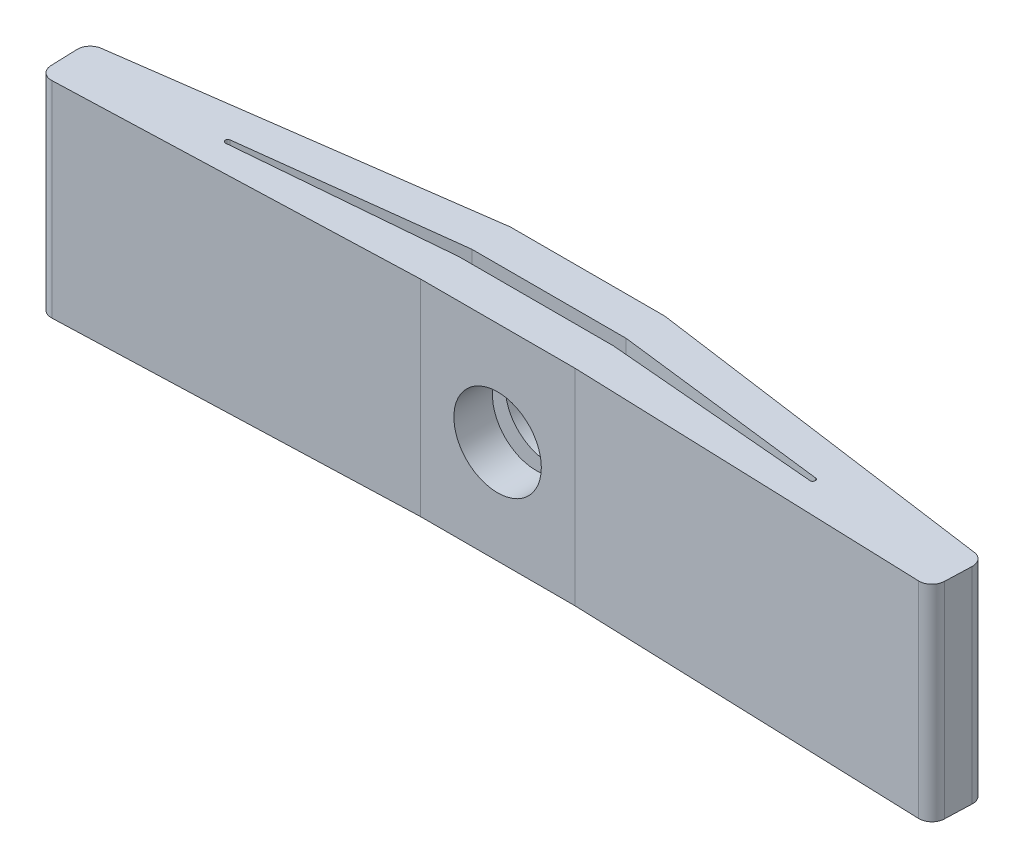
ISO-10303-21;
HEADER;
FILE_DESCRIPTION(('STEP AP214'),'2;1');
FILE_NAME('part.step','',(''),(''),'','','');
FILE_SCHEMA(('AUTOMOTIVE_DESIGN { 1 0 10303 214 1 1 1 1 }'));
ENDSEC;
DATA;
#1=APPLICATION_CONTEXT('core data for automotive mechanical design processes');
#2=APPLICATION_PROTOCOL_DEFINITION('international standard','automotive_design',2000,#1);
#3=PRODUCT_CONTEXT('',#1,'mechanical');
#4=PRODUCT('Part','Part','',(#3));
#5=PRODUCT_RELATED_PRODUCT_CATEGORY('part','',(#4));
#6=PRODUCT_DEFINITION_FORMATION('','',#4);
#7=PRODUCT_DEFINITION_CONTEXT('part definition',#1,'design');
#8=PRODUCT_DEFINITION('design','',#6,#7);
#9=PRODUCT_DEFINITION_SHAPE('','',#8);
#10=(LENGTH_UNIT() NAMED_UNIT(*) SI_UNIT(.MILLI.,.METRE.));
#11=(NAMED_UNIT(*) PLANE_ANGLE_UNIT() SI_UNIT($,.RADIAN.));
#12=(NAMED_UNIT(*) SI_UNIT($,.STERADIAN.) SOLID_ANGLE_UNIT());
#13=UNCERTAINTY_MEASURE_WITH_UNIT(LENGTH_MEASURE(1.E-05),#10,'distance_accuracy_value','');
#14=(GEOMETRIC_REPRESENTATION_CONTEXT(3) GLOBAL_UNCERTAINTY_ASSIGNED_CONTEXT((#13)) GLOBAL_UNIT_ASSIGNED_CONTEXT((#10,
#11,#12)) REPRESENTATION_CONTEXT('',''));
#15=CARTESIAN_POINT('',(0.,0.,0.));
#16=DIRECTION('',(0.,0.,1.));
#17=DIRECTION('',(1.,0.,0.));
#18=AXIS2_PLACEMENT_3D('',#15,#16,#17);
#19=CARTESIAN_POINT('',(34.7,0.,0.));
#20=DIRECTION('',(0.999393527672129,0.,0.0348220741349224));
#21=DIRECTION('',(0.0348220741349224,0.,-0.999393527672129));
#22=AXIS2_PLACEMENT_3D('',#19,#20,#21);
#23=PLANE('',#22);
#24=DIRECTION('',(0.0348220741349224,0.,-0.999393527672129));
#25=VECTOR('',#24,1.);
#26=CARTESIAN_POINT('',(34.7,0.,0.));
#27=LINE('',#26,#25);
#28=CARTESIAN_POINT('',(34.7174110370675,0.,-0.499696763836064));
#29=VERTEX_POINT('',#28);
#30=CARTESIAN_POINT('',(34.7539821688237,0.,-1.54928824524013));
#31=VERTEX_POINT('',#30);
#32=EDGE_CURVE('E249',#29,#31,#27,.T.);
#33=ORIENTED_EDGE('',*,*,#32,.T.);
#34=DIRECTION('',(0.,1.,0.));
#35=VECTOR('',#34,1.);
#36=CARTESIAN_POINT('',(34.7539821688237,0.,-1.54928824524013));
#37=LINE('',#36,#35);
#38=CARTESIAN_POINT('',(34.7539821688237,8.,-1.54928824524013));
#39=VERTEX_POINT('',#38);
#40=EDGE_CURVE('E332',#31,#39,#37,.T.);
#41=ORIENTED_EDGE('',*,*,#40,.T.);
#42=DIRECTION('',(0.0348220741349224,0.,-0.999393527672129));
#43=VECTOR('',#42,1.);
#44=CARTESIAN_POINT('',(34.7,8.,0.));
#45=LINE('',#44,#43);
#46=CARTESIAN_POINT('',(34.7174110370675,8.,-0.499696763836064));
#47=VERTEX_POINT('',#46);
#48=EDGE_CURVE('E237',#47,#39,#45,.T.);
#49=ORIENTED_EDGE('',*,*,#48,.F.);
#50=DIRECTION('',(0.,1.,0.));
#51=VECTOR('',#50,1.);
#52=CARTESIAN_POINT('',(34.7174110370675,0.,-0.499696763836064));
#53=LINE('',#52,#51);
#54=EDGE_CURVE('E330',#47,#29,#53,.F.);
#55=ORIENTED_EDGE('',*,*,#54,.T.);
#56=EDGE_LOOP('',(#33,#41,#49,#55));
#57=FACE_BOUND('',#56,.T.);
#58=ADVANCED_FACE('F33',(#57),#23,.T.);
#59=CARTESIAN_POINT('',(20.3500000000015,0.,-0.499999999999999));
#60=DIRECTION('',(-0.034822074134921,0.,0.999393527672129));
#61=DIRECTION('',(0.999393527672129,0.,0.034822074134921));
#62=AXIS2_PLACEMENT_3D('',#59,#60,#61);
#63=PLANE('',#62);
#64=DIRECTION('',(0.999393527672129,0.,0.034822074134921));
#65=VECTOR('',#64,1.);
#66=CARTESIAN_POINT('',(20.3500000000015,0.,-0.499999999999999));
#67=LINE('',#66,#65);
#68=CARTESIAN_POINT('',(20.3500000000015,0.,-0.499999999999999));
#69=VERTEX_POINT('',#68);
#70=CARTESIAN_POINT('',(34.2003032361639,0.,-0.0174110370674608));
#71=VERTEX_POINT('',#70);
#72=EDGE_CURVE('E269',#69,#71,#67,.T.);
#73=ORIENTED_EDGE('',*,*,#72,.T.);
#74=DIRECTION('',(0.,1.,0.));
#75=VECTOR('',#74,1.);
#76=CARTESIAN_POINT('',(34.2003032361639,0.,-0.0174110370674609));
#77=LINE('',#76,#75);
#78=CARTESIAN_POINT('',(34.2003032361639,8.,-0.0174110370674608));
#79=VERTEX_POINT('',#78);
#80=EDGE_CURVE('E41',#71,#79,#77,.T.);
#81=ORIENTED_EDGE('',*,*,#80,.T.);
#82=DIRECTION('',(0.999393527672129,0.,0.034822074134921));
#83=VECTOR('',#82,1.);
#84=CARTESIAN_POINT('',(20.3500000000015,8.,-0.499999999999999));
#85=LINE('',#84,#83);
#86=CARTESIAN_POINT('',(20.3500000000015,8.,-0.499999999999999));
#87=VERTEX_POINT('',#86);
#88=EDGE_CURVE('E253',#87,#79,#85,.T.);
#89=ORIENTED_EDGE('',*,*,#88,.F.);
#90=DIRECTION('',(0.,1.,0.));
#91=VECTOR('',#90,1.);
#92=CARTESIAN_POINT('',(20.3500000000015,0.,-0.499999999999999));
#93=LINE('',#92,#91);
#94=EDGE_CURVE('E293',#69,#87,#93,.T.);
#95=ORIENTED_EDGE('',*,*,#94,.F.);
#96=EDGE_LOOP('',(#73,#81,#89,#95));
#97=FACE_BOUND('',#96,.T.);
#98=ADVANCED_FACE('F339',(#97),#63,.T.);
#99=CARTESIAN_POINT('',(14.35,0.,-0.5));
#100=DIRECTION('',(0.,0.,1.));
#101=DIRECTION('',(1.,0.,0.));
#102=AXIS2_PLACEMENT_3D('',#99,#100,#101);
#103=PLANE('',#102);
#104=CARTESIAN_POINT('',(17.35,4.,-0.5));
#105=DIRECTION('',(0.,0.,1.));
#106=DIRECTION('',(1.,0.,0.));
#107=AXIS2_PLACEMENT_3D('',#104,#105,#106);
#108=CIRCLE('',#107,1.7);
#109=CARTESIAN_POINT('',(19.05,4.,-0.5));
#110=VERTEX_POINT('',#109);
#111=EDGE_CURVE('E604',#110,#110,#108,.T.);
#112=ORIENTED_EDGE('',*,*,#111,.F.);
#113=EDGE_LOOP('',(#112));
#114=FACE_BOUND('',#113,.T.);
#115=DIRECTION('',(1.,0.,0.));
#116=VECTOR('',#115,1.);
#117=CARTESIAN_POINT('',(14.35,8.,-0.5));
#118=LINE('',#117,#116);
#119=CARTESIAN_POINT('',(14.35,8.,-0.5));
#120=VERTEX_POINT('',#119);
#121=EDGE_CURVE('E288',#120,#87,#118,.T.);
#122=ORIENTED_EDGE('',*,*,#121,.F.);
#123=DIRECTION('',(0.,1.,0.));
#124=VECTOR('',#123,1.);
#125=CARTESIAN_POINT('',(14.35,0.,-0.5));
#126=LINE('',#125,#124);
#127=CARTESIAN_POINT('',(14.35,0.,-0.5));
#128=VERTEX_POINT('',#127);
#129=EDGE_CURVE('E296',#128,#120,#126,.T.);
#130=ORIENTED_EDGE('',*,*,#129,.F.);
#131=DIRECTION('',(1.,0.,0.));
#132=VECTOR('',#131,1.);
#133=CARTESIAN_POINT('',(14.35,0.,-0.5));
#134=LINE('',#133,#132);
#135=EDGE_CURVE('E266',#128,#69,#134,.T.);
#136=ORIENTED_EDGE('',*,*,#135,.T.);
#137=ORIENTED_EDGE('',*,*,#94,.T.);
#138=EDGE_LOOP('',(#122,#130,#136,#137));
#139=FACE_BOUND('',#138,.T.);
#140=ADVANCED_FACE('F347',(#114,#139),#103,.T.);
#141=CARTESIAN_POINT('',(0.,0.,0.));
#142=DIRECTION('',(0.0348220741349173,0.,0.999393527672129));
#143=DIRECTION('',(0.999393527672129,0.,-0.0348220741349173));
#144=AXIS2_PLACEMENT_3D('',#141,#142,#143);
#145=PLANE('',#144);
#146=DIRECTION('',(0.999393527672129,0.,-0.0348220741349173));
#147=VECTOR('',#146,1.);
#148=CARTESIAN_POINT('',(0.,8.,0.));
#149=LINE('',#148,#147);
#150=CARTESIAN_POINT('',(0.499696763836064,8.,-0.0174110370674587));
#151=VERTEX_POINT('',#150);
#152=EDGE_CURVE('E286',#151,#120,#149,.T.);
#153=ORIENTED_EDGE('',*,*,#152,.F.);
#154=DIRECTION('',(0.,1.,0.));
#155=VECTOR('',#154,1.);
#156=CARTESIAN_POINT('',(0.499696763836064,0.,-0.0174110370674587));
#157=LINE('',#156,#155);
#158=CARTESIAN_POINT('',(0.499696763836064,0.,-0.0174110370674587));
#159=VERTEX_POINT('',#158);
#160=EDGE_CURVE('E11',#151,#159,#157,.F.);
#161=ORIENTED_EDGE('',*,*,#160,.T.);
#162=DIRECTION('',(0.999393527672129,0.,-0.0348220741349173));
#163=VECTOR('',#162,1.);
#164=CARTESIAN_POINT('',(0.,0.,0.));
#165=LINE('',#164,#163);
#166=EDGE_CURVE('E264',#159,#128,#165,.T.);
#167=ORIENTED_EDGE('',*,*,#166,.T.);
#168=ORIENTED_EDGE('',*,*,#129,.T.);
#169=EDGE_LOOP('',(#153,#161,#167,#168));
#170=FACE_BOUND('',#169,.T.);
#171=ADVANCED_FACE('F381',(#170),#145,.T.);
#172=CARTESIAN_POINT('',(-0.0696864111498256,0.,-2.));
#173=DIRECTION('',(-0.999393527672129,0.,0.0348220741349173));
#174=DIRECTION('',(0.0348220741349173,0.,0.999393527672129));
#175=AXIS2_PLACEMENT_3D('',#172,#173,#174);
#176=PLANE('',#175);
#177=DIRECTION('',(0.0348220741349173,0.,0.999393527672129));
#178=VECTOR('',#177,1.);
#179=CARTESIAN_POINT('',(-0.0696864111498256,8.,-2.));
#180=LINE('',#179,#178);
#181=CARTESIAN_POINT('',(-0.0539821688236977,8.,-1.54928824524013));
#182=VERTEX_POINT('',#181);
#183=CARTESIAN_POINT('',(-0.0174110370674586,8.,-0.499696763836064));
#184=VERTEX_POINT('',#183);
#185=EDGE_CURVE('E283',#182,#184,#180,.T.);
#186=ORIENTED_EDGE('',*,*,#185,.F.);
#187=DIRECTION('',(0.,1.,0.));
#188=VECTOR('',#187,1.);
#189=CARTESIAN_POINT('',(-0.0539821688236977,0.,-1.54928824524013));
#190=LINE('',#189,#188);
#191=CARTESIAN_POINT('',(-0.0539821688236977,0.,-1.54928824524013));
#192=VERTEX_POINT('',#191);
#193=EDGE_CURVE('E320',#182,#192,#190,.F.);
#194=ORIENTED_EDGE('',*,*,#193,.T.);
#195=DIRECTION('',(0.0348220741349173,0.,0.999393527672129));
#196=VECTOR('',#195,1.);
#197=CARTESIAN_POINT('',(-0.0696864111498256,0.,-2.));
#198=LINE('',#197,#196);
#199=CARTESIAN_POINT('',(-0.0174110370674586,0.,-0.499696763836064));
#200=VERTEX_POINT('',#199);
#201=EDGE_CURVE('E261',#192,#200,#198,.T.);
#202=ORIENTED_EDGE('',*,*,#201,.T.);
#203=DIRECTION('',(0.,1.,0.));
#204=VECTOR('',#203,1.);
#205=CARTESIAN_POINT('',(-0.0174110370674587,0.,-0.499696763836065));
#206=LINE('',#205,#204);
#207=EDGE_CURVE('E317',#200,#184,#206,.T.);
#208=ORIENTED_EDGE('',*,*,#207,.T.);
#209=EDGE_LOOP('',(#186,#194,#202,#208));
#210=FACE_BOUND('',#209,.T.);
#211=ADVANCED_FACE('F377',(#210),#176,.T.);
#212=CARTESIAN_POINT('',(14.35,0.,-4.));
#213=DIRECTION('',(-0.137384103946388,0.,-0.990517848391864));
#214=DIRECTION('',(-0.990517848391864,0.,0.137384103946388));
#215=AXIS2_PLACEMENT_3D('',#212,#213,#214);
#216=PLANE('',#215);
#217=DIRECTION('',(-0.990517848391864,0.,0.137384103946388));
#218=VECTOR('',#217,1.);
#219=CARTESIAN_POINT('',(14.35,0.,-4.));
#220=LINE('',#219,#218);
#221=CARTESIAN_POINT('',(14.35,0.,-4.));
#222=VERTEX_POINT('',#221);
#223=CARTESIAN_POINT('',(0.377022543039176,0.,-2.06195820650352));
#224=VERTEX_POINT('',#223);
#225=EDGE_CURVE('E258',#222,#224,#220,.T.);
#226=ORIENTED_EDGE('',*,*,#225,.T.);
#227=DIRECTION('',(0.,1.,0.));
#228=VECTOR('',#227,1.);
#229=CARTESIAN_POINT('',(0.377022543039176,0.,-2.06195820650352));
#230=LINE('',#229,#228);
#231=CARTESIAN_POINT('',(0.377022543039176,8.,-2.06195820650352));
#232=VERTEX_POINT('',#231);
#233=EDGE_CURVE('E295',#224,#232,#230,.T.);
#234=ORIENTED_EDGE('',*,*,#233,.T.);
#235=DIRECTION('',(-0.990517848391864,0.,0.137384103946388));
#236=VECTOR('',#235,1.);
#237=CARTESIAN_POINT('',(14.35,8.,-4.));
#238=LINE('',#237,#236);
#239=CARTESIAN_POINT('',(14.35,8.,-4.));
#240=VERTEX_POINT('',#239);
#241=EDGE_CURVE('E280',#240,#232,#238,.T.);
#242=ORIENTED_EDGE('',*,*,#241,.F.);
#243=DIRECTION('',(0.,1.,0.));
#244=VECTOR('',#243,1.);
#245=CARTESIAN_POINT('',(14.35,0.,-4.));
#246=LINE('',#245,#244);
#247=EDGE_CURVE('E299',#222,#240,#246,.T.);
#248=ORIENTED_EDGE('',*,*,#247,.F.);
#249=EDGE_LOOP('',(#226,#234,#242,#248));
#250=FACE_BOUND('',#249,.T.);
#251=ADVANCED_FACE('F370',(#250),#216,.T.);
#252=CARTESIAN_POINT('',(20.3500000000002,0.,-3.99999999999999));
#253=DIRECTION('',(0.,0.,-1.));
#254=DIRECTION('',(-1.,0.,0.));
#255=AXIS2_PLACEMENT_3D('',#252,#253,#254);
#256=PLANE('',#255);
#257=CARTESIAN_POINT('',(17.35,4.,-4.));
#258=DIRECTION('',(0.,0.,1.));
#259=DIRECTION('',(1.,0.,0.));
#260=AXIS2_PLACEMENT_3D('',#257,#258,#259);
#261=CIRCLE('',#260,1.7);
#262=CARTESIAN_POINT('',(19.05,4.,-4.));
#263=VERTEX_POINT('',#262);
#264=EDGE_CURVE('E306',#263,#263,#261,.T.);
#265=ORIENTED_EDGE('',*,*,#264,.T.);
#266=EDGE_LOOP('',(#265));
#267=FACE_BOUND('',#266,.T.);
#268=DIRECTION('',(-1.,0.,0.));
#269=VECTOR('',#268,1.);
#270=CARTESIAN_POINT('',(20.3500000000002,8.,-3.99999999999999));
#271=LINE('',#270,#269);
#272=CARTESIAN_POINT('',(20.3500000000002,8.,-3.99999999999999));
#273=VERTEX_POINT('',#272);
#274=EDGE_CURVE('E277',#273,#240,#271,.T.);
#275=ORIENTED_EDGE('',*,*,#274,.F.);
#276=DIRECTION('',(0.,1.,0.));
#277=VECTOR('',#276,1.);
#278=CARTESIAN_POINT('',(20.3500000000002,0.,-3.99999999999999));
#279=LINE('',#278,#277);
#280=CARTESIAN_POINT('',(20.3500000000002,0.,-3.99999999999999));
#281=VERTEX_POINT('',#280);
#282=EDGE_CURVE('E272',#281,#273,#279,.T.);
#283=ORIENTED_EDGE('',*,*,#282,.F.);
#284=DIRECTION('',(-1.,0.,0.));
#285=VECTOR('',#284,1.);
#286=CARTESIAN_POINT('',(20.3500000000002,0.,-3.99999999999999));
#287=LINE('',#286,#285);
#288=EDGE_CURVE('E255',#281,#222,#287,.T.);
#289=ORIENTED_EDGE('',*,*,#288,.T.);
#290=ORIENTED_EDGE('',*,*,#247,.T.);
#291=EDGE_LOOP('',(#275,#283,#289,#290));
#292=FACE_BOUND('',#291,.T.);
#293=ADVANCED_FACE('F366',(#267,#292),#256,.T.);
#294=CARTESIAN_POINT('',(34.7696864111498,0.,-2.));
#295=DIRECTION('',(0.137384103946389,0.,-0.990517848391864));
#296=DIRECTION('',(-0.990517848391864,0.,-0.137384103946389));
#297=AXIS2_PLACEMENT_3D('',#294,#295,#296);
#298=PLANE('',#297);
#299=DIRECTION('',(-0.990517848391864,0.,-0.137384103946389));
#300=VECTOR('',#299,1.);
#301=CARTESIAN_POINT('',(34.7696864111498,8.,-2.));
#302=LINE('',#301,#300);
#303=CARTESIAN_POINT('',(34.3229774569608,8.,-2.06195820650352));
#304=VERTEX_POINT('',#303);
#305=EDGE_CURVE('E275',#304,#273,#302,.T.);
#306=ORIENTED_EDGE('',*,*,#305,.F.);
#307=DIRECTION('',(0.,1.,0.));
#308=VECTOR('',#307,1.);
#309=CARTESIAN_POINT('',(34.3229774569608,0.,-2.06195820650352));
#310=LINE('',#309,#308);
#311=CARTESIAN_POINT('',(34.3229774569608,0.,-2.06195820650352));
#312=VERTEX_POINT('',#311);
#313=EDGE_CURVE('E48',#304,#312,#310,.F.);
#314=ORIENTED_EDGE('',*,*,#313,.T.);
#315=DIRECTION('',(-0.990517848391864,0.,-0.137384103946389));
#316=VECTOR('',#315,1.);
#317=CARTESIAN_POINT('',(34.7696864111498,0.,-2.));
#318=LINE('',#317,#316);
#319=EDGE_CURVE('E252',#312,#281,#318,.T.);
#320=ORIENTED_EDGE('',*,*,#319,.T.);
#321=ORIENTED_EDGE('',*,*,#282,.T.);
#322=EDGE_LOOP('',(#306,#314,#320,#321));
#323=FACE_BOUND('',#322,.T.);
#324=ADVANCED_FACE('F358',(#323),#298,.T.);
#325=CARTESIAN_POINT('',(0.,0.,0.));
#326=DIRECTION('',(0.,-1.,0.));
#327=DIRECTION('',(0.,0.,-1.));
#328=AXIS2_PLACEMENT_3D('',#325,#326,#327);
#329=PLANE('',#328);
#330=CARTESIAN_POINT('',(5.98083421006085,0.,-1.38300960697807));
#331=DIRECTION('',(0.,-1.,0.));
#332=DIRECTION('',(0.,0.,-1.));
#333=AXIS2_PLACEMENT_3D('',#330,#331,#332);
#334=CIRCLE('',#333,0.1);
#335=CARTESIAN_POINT('',(5.9893743241955,0.,-1.2833749420739));
#336=VERTEX_POINT('',#335);
#337=CARTESIAN_POINT('',(5.96877989752127,0.,-1.48228041612758));
#338=VERTEX_POINT('',#337);
#339=EDGE_CURVE('E177',#336,#338,#334,.T.);
#340=ORIENTED_EDGE('',*,*,#339,.F.);
#341=DIRECTION('',(-0.996346649041751,0.,0.0854011413464355));
#342=VECTOR('',#341,1.);
#343=CARTESIAN_POINT('',(14.35,0.,-2.));
#344=LINE('',#343,#342);
#345=CARTESIAN_POINT('',(14.35,0.,-2.));
#346=VERTEX_POINT('',#345);
#347=EDGE_CURVE('E196',#346,#336,#344,.T.);
#348=ORIENTED_EDGE('',*,*,#347,.F.);
#349=DIRECTION('',(-1.,0.,0.));
#350=VECTOR('',#349,1.);
#351=CARTESIAN_POINT('',(20.35,0.,-2.));
#352=LINE('',#351,#350);
#353=CARTESIAN_POINT('',(20.35,0.,-2.));
#354=VERTEX_POINT('',#353);
#355=EDGE_CURVE('E199',#354,#346,#352,.T.);
#356=ORIENTED_EDGE('',*,*,#355,.F.);
#357=DIRECTION('',(-0.996346649041751,0.,-0.0854011413464355));
#358=VECTOR('',#357,1.);
#359=CARTESIAN_POINT('',(28.7106256758045,0.,-1.2833749420739));
#360=LINE('',#359,#358);
#361=CARTESIAN_POINT('',(28.7106256758045,0.,-1.2833749420739));
#362=VERTEX_POINT('',#361);
#363=EDGE_CURVE('E230',#362,#354,#360,.T.);
#364=ORIENTED_EDGE('',*,*,#363,.F.);
#365=CARTESIAN_POINT('',(28.7191657899392,0.,-1.38300960697807));
#366=DIRECTION('',(0.,-1.,0.));
#367=DIRECTION('',(0.,0.,-1.));
#368=AXIS2_PLACEMENT_3D('',#365,#366,#367);
#369=CIRCLE('',#368,0.0999999999999999);
#370=CARTESIAN_POINT('',(28.7312201024787,0.,-1.48228041612758));
#371=VERTEX_POINT('',#370);
#372=EDGE_CURVE('E227',#371,#362,#369,.T.);
#373=ORIENTED_EDGE('',*,*,#372,.F.);
#374=DIRECTION('',(0.99270809149508,0.,0.120543125395831));
#375=VECTOR('',#374,1.);
#376=CARTESIAN_POINT('',(20.35,0.,-2.5));
#377=LINE('',#376,#375);
#378=CARTESIAN_POINT('',(20.35,0.,-2.5));
#379=VERTEX_POINT('',#378);
#380=EDGE_CURVE('E224',#379,#371,#377,.T.);
#381=ORIENTED_EDGE('',*,*,#380,.F.);
#382=DIRECTION('',(1.,0.,0.));
#383=VECTOR('',#382,1.);
#384=CARTESIAN_POINT('',(14.35,0.,-2.5));
#385=LINE('',#384,#383);
#386=CARTESIAN_POINT('',(14.35,0.,-2.5));
#387=VERTEX_POINT('',#386);
#388=EDGE_CURVE('E221',#387,#379,#385,.T.);
#389=ORIENTED_EDGE('',*,*,#388,.F.);
#390=DIRECTION('',(0.99270809149508,0.,-0.120543125395831));
#391=VECTOR('',#390,1.);
#392=CARTESIAN_POINT('',(5.96877989752127,0.,-1.48228041612758));
#393=LINE('',#392,#391);
#394=EDGE_CURVE('E219',#338,#387,#393,.T.);
#395=ORIENTED_EDGE('',*,*,#394,.F.);
#396=EDGE_LOOP('',(#340,#348,#356,#364,#373,#381,#389,#395));
#397=FACE_BOUND('',#396,.T.);
#398=ORIENTED_EDGE('',*,*,#201,.F.);
#399=CARTESIAN_POINT('',(0.445714595012369,0.,-1.56669928230759));
#400=DIRECTION('',(0.,-1.,0.));
#401=DIRECTION('',(0.,0.,-1.));
#402=AXIS2_PLACEMENT_3D('',#399,#400,#401);
#403=CIRCLE('',#402,0.5);
#404=EDGE_CURVE('E328',#192,#224,#403,.T.);
#405=ORIENTED_EDGE('',*,*,#404,.T.);
#406=ORIENTED_EDGE('',*,*,#225,.F.);
#407=ORIENTED_EDGE('',*,*,#288,.F.);
#408=ORIENTED_EDGE('',*,*,#319,.F.);
#409=CARTESIAN_POINT('',(34.2542854049876,0.,-1.56669928230759));
#410=DIRECTION('',(0.,-1.,0.));
#411=DIRECTION('',(0.,0.,-1.));
#412=AXIS2_PLACEMENT_3D('',#409,#410,#411);
#413=CIRCLE('',#412,0.5);
#414=EDGE_CURVE('E326',#312,#31,#413,.T.);
#415=ORIENTED_EDGE('',*,*,#414,.T.);
#416=ORIENTED_EDGE('',*,*,#32,.F.);
#417=CARTESIAN_POINT('',(34.2177142732314,0.,-0.517107800903525));
#418=DIRECTION('',(0.,-1.,0.));
#419=DIRECTION('',(0.,0.,-1.));
#420=AXIS2_PLACEMENT_3D('',#417,#418,#419);
#421=CIRCLE('',#420,0.5);
#422=EDGE_CURVE('E324',#29,#71,#421,.T.);
#423=ORIENTED_EDGE('',*,*,#422,.T.);
#424=ORIENTED_EDGE('',*,*,#72,.F.);
#425=ORIENTED_EDGE('',*,*,#135,.F.);
#426=ORIENTED_EDGE('',*,*,#166,.F.);
#427=CARTESIAN_POINT('',(0.482285726768606,0.,-0.517107800903523));
#428=DIRECTION('',(0.,-1.,0.));
#429=DIRECTION('',(0.,0.,-1.));
#430=AXIS2_PLACEMENT_3D('',#427,#428,#429);
#431=CIRCLE('',#430,0.5);
#432=EDGE_CURVE('E322',#159,#200,#431,.T.);
#433=ORIENTED_EDGE('',*,*,#432,.T.);
#434=EDGE_LOOP('',(#398,#405,#406,#407,#408,#415,#416,#423,#424,#425,#426,#433));
#435=FACE_BOUND('',#434,.T.);
#436=ADVANCED_FACE('F351',(#397,#435),#329,.T.);
#437=CARTESIAN_POINT('',(0.,8.,0.));
#438=DIRECTION('',(0.,-1.,0.));
#439=DIRECTION('',(0.,0.,-1.));
#440=AXIS2_PLACEMENT_3D('',#437,#438,#439);
#441=PLANE('',#440);
#442=DIRECTION('',(-0.996346649041751,0.,0.0854011413464355));
#443=VECTOR('',#442,1.);
#444=CARTESIAN_POINT('',(14.35,8.,-2.));
#445=LINE('',#444,#443);
#446=CARTESIAN_POINT('',(14.35,8.,-2.));
#447=VERTEX_POINT('',#446);
#448=CARTESIAN_POINT('',(5.9893743241955,8.,-1.2833749420739));
#449=VERTEX_POINT('',#448);
#450=EDGE_CURVE('E182',#447,#449,#445,.T.);
#451=ORIENTED_EDGE('',*,*,#450,.T.);
#452=CARTESIAN_POINT('',(5.98083421006085,8.,-1.38300960697807));
#453=DIRECTION('',(0.,-1.,0.));
#454=DIRECTION('',(0.,0.,-1.));
#455=AXIS2_PLACEMENT_3D('',#452,#453,#454);
#456=CIRCLE('',#455,0.1);
#457=CARTESIAN_POINT('',(5.96877989752127,8.,-1.48228041612758));
#458=VERTEX_POINT('',#457);
#459=EDGE_CURVE('E174',#449,#458,#456,.T.);
#460=ORIENTED_EDGE('',*,*,#459,.T.);
#461=DIRECTION('',(0.99270809149508,0.,-0.120543125395831));
#462=VECTOR('',#461,1.);
#463=CARTESIAN_POINT('',(5.96877989752127,8.,-1.48228041612758));
#464=LINE('',#463,#462);
#465=CARTESIAN_POINT('',(14.35,8.,-2.5));
#466=VERTEX_POINT('',#465);
#467=EDGE_CURVE('E186',#458,#466,#464,.T.);
#468=ORIENTED_EDGE('',*,*,#467,.T.);
#469=DIRECTION('',(1.,0.,0.));
#470=VECTOR('',#469,1.);
#471=CARTESIAN_POINT('',(14.35,8.,-2.5));
#472=LINE('',#471,#470);
#473=CARTESIAN_POINT('',(20.35,8.,-2.5));
#474=VERTEX_POINT('',#473);
#475=EDGE_CURVE('E190',#466,#474,#472,.T.);
#476=ORIENTED_EDGE('',*,*,#475,.T.);
#477=DIRECTION('',(0.99270809149508,0.,0.120543125395831));
#478=VECTOR('',#477,1.);
#479=CARTESIAN_POINT('',(20.35,8.,-2.5));
#480=LINE('',#479,#478);
#481=CARTESIAN_POINT('',(28.7312201024787,8.,-1.48228041612758));
#482=VERTEX_POINT('',#481);
#483=EDGE_CURVE('E206',#474,#482,#480,.T.);
#484=ORIENTED_EDGE('',*,*,#483,.T.);
#485=CARTESIAN_POINT('',(28.7191657899392,8.,-1.38300960697807));
#486=DIRECTION('',(0.,-1.,0.));
#487=DIRECTION('',(0.,0.,-1.));
#488=AXIS2_PLACEMENT_3D('',#485,#486,#487);
#489=CIRCLE('',#488,0.0999999999999999);
#490=CARTESIAN_POINT('',(28.7106256758045,8.,-1.2833749420739));
#491=VERTEX_POINT('',#490);
#492=EDGE_CURVE('E209',#482,#491,#489,.T.);
#493=ORIENTED_EDGE('',*,*,#492,.T.);
#494=DIRECTION('',(-0.996346649041751,0.,-0.0854011413464355));
#495=VECTOR('',#494,1.);
#496=CARTESIAN_POINT('',(28.7106256758045,8.,-1.2833749420739));
#497=LINE('',#496,#495);
#498=CARTESIAN_POINT('',(20.35,8.,-2.));
#499=VERTEX_POINT('',#498);
#500=EDGE_CURVE('E212',#491,#499,#497,.T.);
#501=ORIENTED_EDGE('',*,*,#500,.T.);
#502=DIRECTION('',(-1.,0.,0.));
#503=VECTOR('',#502,1.);
#504=CARTESIAN_POINT('',(20.35,8.,-2.));
#505=LINE('',#504,#503);
#506=EDGE_CURVE('E215',#499,#447,#505,.T.);
#507=ORIENTED_EDGE('',*,*,#506,.T.);
#508=EDGE_LOOP('',(#451,#460,#468,#476,#484,#493,#501,#507));
#509=FACE_BOUND('',#508,.T.);
#510=ORIENTED_EDGE('',*,*,#241,.T.);
#511=CARTESIAN_POINT('',(0.445714595012369,8.,-1.56669928230759));
#512=DIRECTION('',(0.,-1.,0.));
#513=DIRECTION('',(0.,0.,-1.));
#514=AXIS2_PLACEMENT_3D('',#511,#512,#513);
#515=CIRCLE('',#514,0.5);
#516=EDGE_CURVE('E315',#232,#182,#515,.F.);
#517=ORIENTED_EDGE('',*,*,#516,.T.);
#518=ORIENTED_EDGE('',*,*,#185,.T.);
#519=CARTESIAN_POINT('',(0.482285726768606,8.,-0.517107800903523));
#520=DIRECTION('',(0.,-1.,0.));
#521=DIRECTION('',(0.,0.,-1.));
#522=AXIS2_PLACEMENT_3D('',#519,#520,#521);
#523=CIRCLE('',#522,0.5);
#524=EDGE_CURVE('E309',#184,#151,#523,.F.);
#525=ORIENTED_EDGE('',*,*,#524,.T.);
#526=ORIENTED_EDGE('',*,*,#152,.T.);
#527=ORIENTED_EDGE('',*,*,#121,.T.);
#528=ORIENTED_EDGE('',*,*,#88,.T.);
#529=CARTESIAN_POINT('',(34.2177142732314,8.,-0.517107800903525));
#530=DIRECTION('',(0.,-1.,0.));
#531=DIRECTION('',(0.,0.,-1.));
#532=AXIS2_PLACEMENT_3D('',#529,#530,#531);
#533=CIRCLE('',#532,0.5);
#534=EDGE_CURVE('E311',#79,#47,#533,.F.);
#535=ORIENTED_EDGE('',*,*,#534,.T.);
#536=ORIENTED_EDGE('',*,*,#48,.T.);
#537=CARTESIAN_POINT('',(34.2542854049876,8.,-1.56669928230759));
#538=DIRECTION('',(0.,-1.,0.));
#539=DIRECTION('',(0.,0.,-1.));
#540=AXIS2_PLACEMENT_3D('',#537,#538,#539);
#541=CIRCLE('',#540,0.5);
#542=EDGE_CURVE('E313',#39,#304,#541,.F.);
#543=ORIENTED_EDGE('',*,*,#542,.T.);
#544=ORIENTED_EDGE('',*,*,#305,.T.);
#545=ORIENTED_EDGE('',*,*,#274,.T.);
#546=EDGE_LOOP('',(#510,#517,#518,#525,#526,#527,#528,#535,#536,#543,#544,#545));
#547=FACE_BOUND('',#546,.T.);
#548=ADVANCED_FACE('F192',(#509,#547),#441,.F.);
#549=CARTESIAN_POINT('',(5.98083421006085,8.,-1.38300960697807));
#550=DIRECTION('',(0.,-1.,0.));
#551=DIRECTION('',(0.,0.,-1.));
#552=AXIS2_PLACEMENT_3D('',#549,#550,#551);
#553=CYLINDRICAL_SURFACE('',#552,0.1);
#554=ORIENTED_EDGE('',*,*,#339,.T.);
#555=DIRECTION('',(0.,-1.,0.));
#556=VECTOR('',#555,1.);
#557=CARTESIAN_POINT('',(5.96877989752127,8.,-1.48228041612758));
#558=LINE('',#557,#556);
#559=EDGE_CURVE('E170',#458,#338,#558,.T.);
#560=ORIENTED_EDGE('',*,*,#559,.F.);
#561=ORIENTED_EDGE('',*,*,#459,.F.);
#562=DIRECTION('',(0.,-1.,0.));
#563=VECTOR('',#562,1.);
#564=CARTESIAN_POINT('',(5.9893743241955,8.,-1.2833749420739));
#565=LINE('',#564,#563);
#566=EDGE_CURVE('E235',#449,#336,#565,.T.);
#567=ORIENTED_EDGE('',*,*,#566,.T.);
#568=EDGE_LOOP('',(#554,#560,#561,#567));
#569=FACE_BOUND('',#568,.T.);
#570=ADVANCED_FACE('F172',(#569),#553,.F.);
#571=CARTESIAN_POINT('',(14.35,8.,-2.));
#572=DIRECTION('',(0.0854011413464355,0.,0.996346649041751));
#573=DIRECTION('',(0.996346649041751,0.,-0.0854011413464355));
#574=AXIS2_PLACEMENT_3D('',#571,#572,#573);
#575=PLANE('',#574);
#576=ORIENTED_EDGE('',*,*,#347,.T.);
#577=ORIENTED_EDGE('',*,*,#566,.F.);
#578=ORIENTED_EDGE('',*,*,#450,.F.);
#579=DIRECTION('',(0.,-1.,0.));
#580=VECTOR('',#579,1.);
#581=CARTESIAN_POINT('',(14.35,8.,-2.));
#582=LINE('',#581,#580);
#583=EDGE_CURVE('E238',#447,#346,#582,.T.);
#584=ORIENTED_EDGE('',*,*,#583,.T.);
#585=EDGE_LOOP('',(#576,#577,#578,#584));
#586=FACE_BOUND('',#585,.T.);
#587=ADVANCED_FACE('F527',(#586),#575,.F.);
#588=CARTESIAN_POINT('',(20.35,8.,-2.));
#589=DIRECTION('',(0.,0.,1.));
#590=DIRECTION('',(1.,0.,0.));
#591=AXIS2_PLACEMENT_3D('',#588,#589,#590);
#592=PLANE('',#591);
#593=CARTESIAN_POINT('',(17.35,4.,-2.));
#594=DIRECTION('',(0.,0.,1.));
#595=DIRECTION('',(1.,0.,0.));
#596=AXIS2_PLACEMENT_3D('',#593,#594,#595);
#597=CIRCLE('',#596,1.7);
#598=CARTESIAN_POINT('',(19.05,4.,-2.));
#599=VERTEX_POINT('',#598);
#600=EDGE_CURVE('E202',#599,#599,#597,.T.);
#601=ORIENTED_EDGE('',*,*,#600,.T.);
#602=EDGE_LOOP('',(#601));
#603=FACE_BOUND('',#602,.T.);
#604=ORIENTED_EDGE('',*,*,#355,.T.);
#605=ORIENTED_EDGE('',*,*,#583,.F.);
#606=ORIENTED_EDGE('',*,*,#506,.F.);
#607=DIRECTION('',(0.,-1.,0.));
#608=VECTOR('',#607,1.);
#609=CARTESIAN_POINT('',(20.35,8.,-2.));
#610=LINE('',#609,#608);
#611=EDGE_CURVE('E240',#499,#354,#610,.T.);
#612=ORIENTED_EDGE('',*,*,#611,.T.);
#613=EDGE_LOOP('',(#604,#605,#606,#612));
#614=FACE_BOUND('',#613,.T.);
#615=ADVANCED_FACE('F521',(#603,#614),#592,.F.);
#616=CARTESIAN_POINT('',(28.7106256758045,8.,-1.2833749420739));
#617=DIRECTION('',(-0.0854011413464355,0.,0.996346649041751));
#618=DIRECTION('',(0.996346649041751,0.,0.0854011413464355));
#619=AXIS2_PLACEMENT_3D('',#616,#617,#618);
#620=PLANE('',#619);
#621=ORIENTED_EDGE('',*,*,#363,.T.);
#622=ORIENTED_EDGE('',*,*,#611,.F.);
#623=ORIENTED_EDGE('',*,*,#500,.F.);
#624=DIRECTION('',(0.,-1.,0.));
#625=VECTOR('',#624,1.);
#626=CARTESIAN_POINT('',(28.7106256758045,8.,-1.2833749420739));
#627=LINE('',#626,#625);
#628=EDGE_CURVE('E242',#491,#362,#627,.T.);
#629=ORIENTED_EDGE('',*,*,#628,.T.);
#630=EDGE_LOOP('',(#621,#622,#623,#629));
#631=FACE_BOUND('',#630,.T.);
#632=ADVANCED_FACE('F526',(#631),#620,.F.);
#633=CARTESIAN_POINT('',(28.7191657899392,8.,-1.38300960697807));
#634=DIRECTION('',(0.,-1.,0.));
#635=DIRECTION('',(0.,0.,-1.));
#636=AXIS2_PLACEMENT_3D('',#633,#634,#635);
#637=CYLINDRICAL_SURFACE('',#636,0.0999999999999999);
#638=ORIENTED_EDGE('',*,*,#372,.T.);
#639=ORIENTED_EDGE('',*,*,#628,.F.);
#640=ORIENTED_EDGE('',*,*,#492,.F.);
#641=DIRECTION('',(0.,-1.,0.));
#642=VECTOR('',#641,1.);
#643=CARTESIAN_POINT('',(28.7312201024787,8.,-1.48228041612758));
#644=LINE('',#643,#642);
#645=EDGE_CURVE('E244',#482,#371,#644,.T.);
#646=ORIENTED_EDGE('',*,*,#645,.T.);
#647=EDGE_LOOP('',(#638,#639,#640,#646));
#648=FACE_BOUND('',#647,.T.);
#649=ADVANCED_FACE('F556',(#648),#637,.F.);
#650=CARTESIAN_POINT('',(20.35,8.,-2.5));
#651=DIRECTION('',(0.120543125395831,0.,-0.992708091495081));
#652=DIRECTION('',(-0.99270809149508,0.,-0.120543125395831));
#653=AXIS2_PLACEMENT_3D('',#650,#651,#652);
#654=PLANE('',#653);
#655=ORIENTED_EDGE('',*,*,#380,.T.);
#656=ORIENTED_EDGE('',*,*,#645,.F.);
#657=ORIENTED_EDGE('',*,*,#483,.F.);
#658=DIRECTION('',(0.,-1.,0.));
#659=VECTOR('',#658,1.);
#660=CARTESIAN_POINT('',(20.35,8.,-2.5));
#661=LINE('',#660,#659);
#662=EDGE_CURVE('E246',#474,#379,#661,.T.);
#663=ORIENTED_EDGE('',*,*,#662,.T.);
#664=EDGE_LOOP('',(#655,#656,#657,#663));
#665=FACE_BOUND('',#664,.T.);
#666=ADVANCED_FACE('F513',(#665),#654,.F.);
#667=CARTESIAN_POINT('',(14.35,8.,-2.5));
#668=DIRECTION('',(0.,0.,-1.));
#669=DIRECTION('',(-1.,0.,0.));
#670=AXIS2_PLACEMENT_3D('',#667,#668,#669);
#671=PLANE('',#670);
#672=CARTESIAN_POINT('',(17.35,4.,-2.5));
#673=DIRECTION('',(0.,0.,-1.));
#674=DIRECTION('',(-1.,0.,0.));
#675=AXIS2_PLACEMENT_3D('',#672,#673,#674);
#676=CIRCLE('',#675,1.7);
#677=CARTESIAN_POINT('',(15.65,4.,-2.5));
#678=VERTEX_POINT('',#677);
#679=EDGE_CURVE('E303',#678,#678,#676,.T.);
#680=ORIENTED_EDGE('',*,*,#679,.T.);
#681=EDGE_LOOP('',(#680));
#682=FACE_BOUND('',#681,.T.);
#683=ORIENTED_EDGE('',*,*,#388,.T.);
#684=ORIENTED_EDGE('',*,*,#662,.F.);
#685=ORIENTED_EDGE('',*,*,#475,.F.);
#686=DIRECTION('',(0.,-1.,0.));
#687=VECTOR('',#686,1.);
#688=CARTESIAN_POINT('',(14.35,8.,-2.5));
#689=LINE('',#688,#687);
#690=EDGE_CURVE('E181',#466,#387,#689,.T.);
#691=ORIENTED_EDGE('',*,*,#690,.T.);
#692=EDGE_LOOP('',(#683,#684,#685,#691));
#693=FACE_BOUND('',#692,.T.);
#694=ADVANCED_FACE('F508',(#682,#693),#671,.F.);
#695=CARTESIAN_POINT('',(5.96877989752127,8.,-1.48228041612758));
#696=DIRECTION('',(-0.120543125395831,0.,-0.992708091495081));
#697=DIRECTION('',(-0.99270809149508,0.,0.120543125395831));
#698=AXIS2_PLACEMENT_3D('',#695,#696,#697);
#699=PLANE('',#698);
#700=ORIENTED_EDGE('',*,*,#394,.T.);
#701=ORIENTED_EDGE('',*,*,#690,.F.);
#702=ORIENTED_EDGE('',*,*,#467,.F.);
#703=ORIENTED_EDGE('',*,*,#559,.T.);
#704=EDGE_LOOP('',(#700,#701,#702,#703));
#705=FACE_BOUND('',#704,.T.);
#706=ADVANCED_FACE('F187',(#705),#699,.F.);
#707=CARTESIAN_POINT('',(17.35,4.,-0.5));
#708=DIRECTION('',(0.,0.,1.));
#709=DIRECTION('',(1.,0.,0.));
#710=AXIS2_PLACEMENT_3D('',#707,#708,#709);
#711=CYLINDRICAL_SURFACE('',#710,1.7);
#712=ORIENTED_EDGE('',*,*,#264,.F.);
#713=EDGE_LOOP('',(#712));
#714=FACE_BOUND('',#713,.T.);
#715=ORIENTED_EDGE('',*,*,#679,.F.);
#716=EDGE_LOOP('',(#715));
#717=FACE_BOUND('',#716,.T.);
#718=ADVANCED_FACE('F492',(#714,#717),#711,.F.);
#719=ORIENTED_EDGE('',*,*,#111,.T.);
#720=EDGE_LOOP('',(#719));
#721=FACE_BOUND('',#720,.T.);
#722=ORIENTED_EDGE('',*,*,#600,.F.);
#723=EDGE_LOOP('',(#722));
#724=FACE_BOUND('',#723,.T.);
#725=ADVANCED_FACE('F402',(#721,#724),#711,.F.);
#726=CARTESIAN_POINT('',(0.445714595012369,0.,-1.56669928230759));
#727=DIRECTION('',(0.,1.,0.));
#728=DIRECTION('',(0.,0.,1.));
#729=AXIS2_PLACEMENT_3D('',#726,#727,#728);
#730=CYLINDRICAL_SURFACE('',#729,0.5);
#731=ORIENTED_EDGE('',*,*,#404,.F.);
#732=ORIENTED_EDGE('',*,*,#193,.F.);
#733=ORIENTED_EDGE('',*,*,#516,.F.);
#734=ORIENTED_EDGE('',*,*,#233,.F.);
#735=EDGE_LOOP('',(#731,#732,#733,#734));
#736=FACE_BOUND('',#735,.T.);
#737=ADVANCED_FACE('F374',(#736),#730,.T.);
#738=CARTESIAN_POINT('',(34.2542854049876,0.,-1.56669928230759));
#739=DIRECTION('',(0.,1.,0.));
#740=DIRECTION('',(0.,0.,1.));
#741=AXIS2_PLACEMENT_3D('',#738,#739,#740);
#742=CYLINDRICAL_SURFACE('',#741,0.5);
#743=ORIENTED_EDGE('',*,*,#414,.F.);
#744=ORIENTED_EDGE('',*,*,#313,.F.);
#745=ORIENTED_EDGE('',*,*,#542,.F.);
#746=ORIENTED_EDGE('',*,*,#40,.F.);
#747=EDGE_LOOP('',(#743,#744,#745,#746));
#748=FACE_BOUND('',#747,.T.);
#749=ADVANCED_FACE('F362',(#748),#742,.T.);
#750=CARTESIAN_POINT('',(34.2177142732314,0.,-0.517107800903525));
#751=DIRECTION('',(0.,1.,0.));
#752=DIRECTION('',(0.,0.,1.));
#753=AXIS2_PLACEMENT_3D('',#750,#751,#752);
#754=CYLINDRICAL_SURFACE('',#753,0.5);
#755=ORIENTED_EDGE('',*,*,#422,.F.);
#756=ORIENTED_EDGE('',*,*,#54,.F.);
#757=ORIENTED_EDGE('',*,*,#534,.F.);
#758=ORIENTED_EDGE('',*,*,#80,.F.);
#759=EDGE_LOOP('',(#755,#756,#757,#758));
#760=FACE_BOUND('',#759,.T.);
#761=ADVANCED_FACE('F354',(#760),#754,.T.);
#762=CARTESIAN_POINT('',(0.482285726768606,0.,-0.517107800903523));
#763=DIRECTION('',(0.,1.,0.));
#764=DIRECTION('',(0.,0.,1.));
#765=AXIS2_PLACEMENT_3D('',#762,#763,#764);
#766=CYLINDRICAL_SURFACE('',#765,0.5);
#767=ORIENTED_EDGE('',*,*,#432,.F.);
#768=ORIENTED_EDGE('',*,*,#160,.F.);
#769=ORIENTED_EDGE('',*,*,#524,.F.);
#770=ORIENTED_EDGE('',*,*,#207,.F.);
#771=EDGE_LOOP('',(#767,#768,#769,#770));
#772=FACE_BOUND('',#771,.T.);
#773=ADVANCED_FACE('F35',(#772),#766,.T.);
#774=CLOSED_SHELL('',(#58,#98,#140,#171,#211,#251,#293,#324,#436,#548,#570,#587,#615,#632,#649,
#666,#694,#706,#718,#725,#737,#749,#761,#773));
#775=MANIFOLD_SOLID_BREP('B2',#774);
#776=ADVANCED_BREP_SHAPE_REPRESENTATION('',(#18,#775),#14);
#777=SHAPE_DEFINITION_REPRESENTATION(#9,#776);
ENDSEC;
END-ISO-10303-21;
